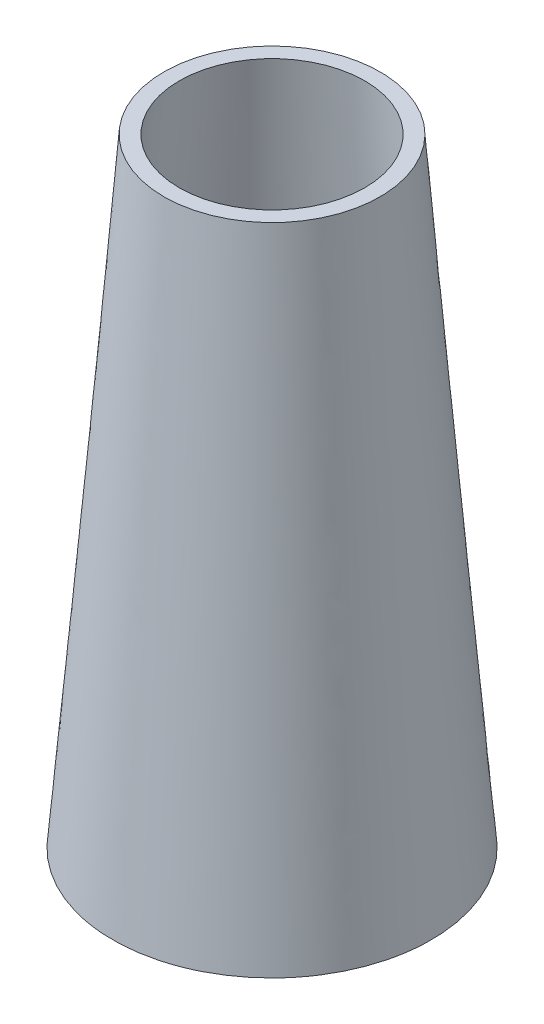
ISO-10303-21;
HEADER;
FILE_DESCRIPTION(('STEP AP214'),'2;1');
FILE_NAME('part.step','',(''),(''),'','','');
FILE_SCHEMA(('AUTOMOTIVE_DESIGN { 1 0 10303 214 1 1 1 1 }'));
ENDSEC;
DATA;
#1=APPLICATION_CONTEXT('core data for automotive mechanical design processes');
#2=APPLICATION_PROTOCOL_DEFINITION('international standard','automotive_design',2000,#1);
#3=PRODUCT_CONTEXT('',#1,'mechanical');
#4=PRODUCT('Part','Part','',(#3));
#5=PRODUCT_RELATED_PRODUCT_CATEGORY('part','',(#4));
#6=PRODUCT_DEFINITION_FORMATION('','',#4);
#7=PRODUCT_DEFINITION_CONTEXT('part definition',#1,'design');
#8=PRODUCT_DEFINITION('design','',#6,#7);
#9=PRODUCT_DEFINITION_SHAPE('','',#8);
#10=(LENGTH_UNIT() NAMED_UNIT(*) SI_UNIT(.MILLI.,.METRE.));
#11=(NAMED_UNIT(*) PLANE_ANGLE_UNIT() SI_UNIT($,.RADIAN.));
#12=(NAMED_UNIT(*) SI_UNIT($,.STERADIAN.) SOLID_ANGLE_UNIT());
#13=UNCERTAINTY_MEASURE_WITH_UNIT(LENGTH_MEASURE(1.E-05),#10,'distance_accuracy_value','');
#14=(GEOMETRIC_REPRESENTATION_CONTEXT(3) GLOBAL_UNCERTAINTY_ASSIGNED_CONTEXT((#13)) GLOBAL_UNIT_ASSIGNED_CONTEXT((#10,
#11,#12)) REPRESENTATION_CONTEXT('',''));
#15=CARTESIAN_POINT('',(0.,0.,0.));
#16=DIRECTION('',(0.,0.,1.));
#17=DIRECTION('',(1.,0.,0.));
#18=AXIS2_PLACEMENT_3D('',#15,#16,#17);
#19=CARTESIAN_POINT('',(0.,0.,0.));
#20=DIRECTION('',(0.,1.,0.));
#21=DIRECTION('',(0.,0.,1.));
#22=AXIS2_PLACEMENT_3D('',#19,#20,#21);
#23=PLANE('',#22);
#24=CARTESIAN_POINT('',(0.,0.,0.));
#25=DIRECTION('',(0.,-1.,0.));
#26=DIRECTION('',(0.,0.,-1.));
#27=AXIS2_PLACEMENT_3D('',#24,#25,#26);
#28=CIRCLE('',#27,4.65);
#29=CARTESIAN_POINT('',(0.,0.,-4.65));
#30=VERTEX_POINT('',#29);
#31=EDGE_CURVE('E58',#30,#30,#28,.T.);
#32=ORIENTED_EDGE('',*,*,#31,.F.);
#33=EDGE_LOOP('',(#32));
#34=FACE_BOUND('',#33,.T.);
#35=CARTESIAN_POINT('',(0.,0.,0.));
#36=DIRECTION('',(0.,1.,0.));
#37=DIRECTION('',(0.,0.,1.));
#38=AXIS2_PLACEMENT_3D('',#35,#36,#37);
#39=CIRCLE('',#38,5.15);
#40=CARTESIAN_POINT('',(-3.032327357634,0.,-4.16263027377456));
#41=VERTEX_POINT('',#40);
#42=EDGE_CURVE('E11',#41,#41,#39,.T.);
#43=ORIENTED_EDGE('',*,*,#42,.F.);
#44=EDGE_LOOP('',(#43));
#45=FACE_BOUND('',#44,.T.);
#46=ADVANCED_FACE('F45',(#34,#45),#23,.F.);
#47=CARTESIAN_POINT('',(0.,19.999999878,0.));
#48=DIRECTION('',(0.,1.,0.));
#49=DIRECTION('',(0.,0.,1.));
#50=AXIS2_PLACEMENT_3D('',#47,#48,#49);
#51=PLANE('',#50);
#52=CARTESIAN_POINT('',(0.,19.999999878,0.));
#53=DIRECTION('',(0.,1.,0.));
#54=DIRECTION('',(0.,0.,1.));
#55=AXIS2_PLACEMENT_3D('',#52,#53,#54);
#56=CIRCLE('',#55,3.);
#57=CARTESIAN_POINT('',(0.,19.999999878,3.));
#58=VERTEX_POINT('',#57);
#59=EDGE_CURVE('E121',#58,#58,#56,.T.);
#60=ORIENTED_EDGE('',*,*,#59,.F.);
#61=EDGE_LOOP('',(#60));
#62=FACE_BOUND('',#61,.T.);
#63=CARTESIAN_POINT('',(0.,19.999999878,0.));
#64=DIRECTION('',(0.,1.,0.));
#65=DIRECTION('',(0.,0.,1.));
#66=AXIS2_PLACEMENT_3D('',#63,#64,#65);
#67=CIRCLE('',#66,3.5);
#68=CARTESIAN_POINT('',(-1.49022752047775,19.999999878,-3.16689468363107));
#69=VERTEX_POINT('',#68);
#70=EDGE_CURVE('E53',#69,#69,#67,.T.);
#71=ORIENTED_EDGE('',*,*,#70,.T.);
#72=EDGE_LOOP('',(#71));
#73=FACE_BOUND('',#72,.T.);
#74=ADVANCED_FACE('F78',(#62,#73),#51,.T.);
#75=CARTESIAN_POINT('',(-1.49022752047775,19.999999878,-3.16689468363107));
#76=CARTESIAN_POINT('',(-3.032327357634,0.,-4.16263027377456));
#77=CARTESIAN_POINT('',(4.84356184678439,19.999999878,-6.14734972458657));
#78=CARTESIAN_POINT('',(5.29293318991512,0.,-10.2272849890425));
#79=CARTESIAN_POINT('',(7.82401688773989,19.999999878,0.186439642675566));
#80=CARTESIAN_POINT('',(11.3575879051831,0.,-1.90202444149344));
#81=CARTESIAN_POINT('',(1.49022752047775,19.999999878,3.16689468363107));
#82=CARTESIAN_POINT('',(3.032327357634,0.,4.16263027377456));
#83=CARTESIAN_POINT('',(-4.84356184678438,19.999999878,6.14734972458657));
#84=CARTESIAN_POINT('',(-5.29293318991512,0.,10.2272849890426));
#85=CARTESIAN_POINT('',(-7.82401688773989,19.999999878,-0.186439642675565));
#86=CARTESIAN_POINT('',(-11.3575879051831,0.,1.90202444149343));
#87=CARTESIAN_POINT('',(-1.49022752047775,19.999999878,-3.16689468363107));
#88=CARTESIAN_POINT('',(-3.032327357634,0.,-4.16263027377456));
#89=(BOUNDED_SURFACE() B_SPLINE_SURFACE(3,1,((#75,#76),(#77,#78),(#79,#80),(#81,#82),(#83,#84),
(#85,#86),(#87,#88)),.UNSPECIFIED.,.T.,.F.,.F.) B_SPLINE_SURFACE_WITH_KNOTS((4,3,4),(2,2),(0.,
0.5,1.),(0.,1.),.UNSPECIFIED.) GEOMETRIC_REPRESENTATION_ITEM() RATIONAL_B_SPLINE_SURFACE(((1.,
1.),(0.333333333333333,0.333333333333333),(0.333333333333333,0.333333333333333),(1.,1.),
(0.333333333333334,0.333333333333333),(0.333333333333334,0.333333333333333),(1.,1.))) REPRESENTATION_ITEM('') SURFACE());
#90=CARTESIAN_POINT('',(-1.49022752047775,19.999999878,-3.16689468363107));
#91=CARTESIAN_POINT('',(-1.50629106044813,19.7916665459375,-3.17726692936173));
#92=CARTESIAN_POINT('',(-1.52235460041851,19.583333213875,-3.18763917509239));
#93=CARTESIAN_POINT('',(-1.55448168035926,19.16666654975,-3.20838366655371));
#94=CARTESIAN_POINT('',(-1.57054522032964,18.9583332176875,-3.21875591228438));
#95=CARTESIAN_POINT('',(-1.60267230027039,18.5416665535625,-3.2395004037457));
#96=CARTESIAN_POINT('',(-1.61873584024077,18.3333332215,-3.24987264947636));
#97=CARTESIAN_POINT('',(-1.65086292018153,17.916666557375,-3.27061714093768));
#98=CARTESIAN_POINT('',(-1.6669264601519,17.7083332253125,-3.28098938666834));
#99=CARTESIAN_POINT('',(-1.69905354009266,17.2916665611875,-3.30173387812967));
#100=CARTESIAN_POINT('',(-1.71511708006304,17.083333229125,-3.31210612386033));
#101=CARTESIAN_POINT('',(-1.74724416000379,16.666666565,-3.33285061532165));
#102=CARTESIAN_POINT('',(-1.76330769997417,16.4583332329375,-3.34322286105231));
#103=CARTESIAN_POINT('',(-1.79543477991493,16.0416665688125,-3.36396735251363));
#104=CARTESIAN_POINT('',(-1.8114983198853,15.83333323675,-3.3743395982443));
#105=CARTESIAN_POINT('',(-1.84362539982606,15.416666572625,-3.39508408970562));
#106=CARTESIAN_POINT('',(-1.85968893979644,15.2083332405625,-3.40545633543628));
#107=CARTESIAN_POINT('',(-1.89181601973719,14.7916665764375,-3.4262008268976));
#108=CARTESIAN_POINT('',(-1.90787955970757,14.583333244375,-3.43657307262826));
#109=CARTESIAN_POINT('',(-1.94000663964832,14.16666658025,-3.45731756408959));
#110=CARTESIAN_POINT('',(-1.9560701796187,13.9583332481875,-3.46768980982025));
#111=CARTESIAN_POINT('',(-1.98819725955946,13.5416665840625,-3.48843430128157));
#112=CARTESIAN_POINT('',(-2.00426079952983,13.333333252,-3.49880654701223));
#113=CARTESIAN_POINT('',(-2.03638787947059,12.916666587875,-3.51955103847355));
#114=CARTESIAN_POINT('',(-2.05245141944097,12.7083332558125,-3.52992328420422));
#115=CARTESIAN_POINT('',(-2.08457849938172,12.2916665916875,-3.55066777566554));
#116=CARTESIAN_POINT('',(-2.1006420393521,12.083333259625,-3.5610400213962));
#117=CARTESIAN_POINT('',(-2.13276911929285,11.6666665955,-3.58178451285752));
#118=CARTESIAN_POINT('',(-2.14883265926323,11.4583332634375,-3.59215675858818));
#119=CARTESIAN_POINT('',(-2.18095973920399,11.0416665993125,-3.61290125004951));
#120=CARTESIAN_POINT('',(-2.19702327917436,10.83333326725,-3.62327349578017));
#121=CARTESIAN_POINT('',(-2.22915035911512,10.416666603125,-3.64401798724149));
#122=CARTESIAN_POINT('',(-2.2452138990855,10.2083332710625,-3.65439023297215));
#123=CARTESIAN_POINT('',(-2.27734097902625,9.7916666069375,-3.67513472443347));
#124=CARTESIAN_POINT('',(-2.29340451899663,9.583333274875,-3.68550697016414));
#125=CARTESIAN_POINT('',(-2.32553159893738,9.16666661075,-3.70625146162546));
#126=CARTESIAN_POINT('',(-2.34159513890776,8.9583332786875,-3.71662370735612));
#127=CARTESIAN_POINT('',(-2.37372221884852,8.5416666145625,-3.73736819881744));
#128=CARTESIAN_POINT('',(-2.38978575881889,8.3333332825,-3.7477404445481));
#129=CARTESIAN_POINT('',(-2.42191283875965,7.916666618375,-3.76848493600943));
#130=CARTESIAN_POINT('',(-2.43797637873003,7.7083332863125,-3.77885718174009));
#131=CARTESIAN_POINT('',(-2.47010345867078,7.2916666221875,-3.79960167320141));
#132=CARTESIAN_POINT('',(-2.48616699864116,7.083333290125,-3.80997391893207));
#133=CARTESIAN_POINT('',(-2.51829407858191,6.666666626,-3.83071841039339));
#134=CARTESIAN_POINT('',(-2.53435761855229,6.4583332939375,-3.84109065612406));
#135=CARTESIAN_POINT('',(-2.56648469849305,6.0416666298125,-3.86183514758538));
#136=CARTESIAN_POINT('',(-2.58254823846342,5.83333329775,-3.87220739331604));
#137=CARTESIAN_POINT('',(-2.61467531840418,5.416666633625,-3.89295188477736));
#138=CARTESIAN_POINT('',(-2.63073885837456,5.2083333015625,-3.90332413050802));
#139=CARTESIAN_POINT('',(-2.66286593831531,4.7916666374375,-3.92406862196935));
#140=CARTESIAN_POINT('',(-2.67892947828569,4.583333305375,-3.93444086770001));
#141=CARTESIAN_POINT('',(-2.71105655822645,4.16666664125,-3.95518535916133));
#142=CARTESIAN_POINT('',(-2.72712009819682,3.9583333091875,-3.96555760489199));
#143=CARTESIAN_POINT('',(-2.75924717813758,3.5416666450625,-3.98630209635331));
#144=CARTESIAN_POINT('',(-2.77531071810796,3.333333313,-3.99667434208398));
#145=CARTESIAN_POINT('',(-2.80743779804871,2.916666648875,-4.0174188335453));
#146=CARTESIAN_POINT('',(-2.82350133801909,2.7083333168125,-4.02779107927596));
#147=CARTESIAN_POINT('',(-2.85562841795984,2.2916666526875,-4.04853557073728));
#148=CARTESIAN_POINT('',(-2.87169195793022,2.083333320625,-4.05890781646794));
#149=CARTESIAN_POINT('',(-2.90381903787098,1.6666666565,-4.07965230792927));
#150=CARTESIAN_POINT('',(-2.91988257784135,1.4583333244375,-4.09002455365993));
#151=CARTESIAN_POINT('',(-2.95200965778211,1.0416666603125,-4.11076904512125));
#152=CARTESIAN_POINT('',(-2.96807319775249,0.83333332825,-4.12114129085191));
#153=CARTESIAN_POINT('',(-3.00020027769324,0.416666664125,-4.14188578231323));
#154=CARTESIAN_POINT('',(-3.01626381766362,0.2083333320625,-4.15225802804389));
#155=CARTESIAN_POINT('',(-3.032327357634,0.,-4.16263027377456));
#156=B_SPLINE_CURVE_WITH_KNOTS('',3,(#90,#91,#92,#93,#94,#95,#96,#97,#98,#99,#100,#101,#102,
#103,#104,#105,#106,#107,#108,#109,#110,#111,#112,#113,#114,#115,#116,#117,#118,#119,#120,#121,
#122,#123,#124,#125,#126,#127,#128,#129,#130,#131,#132,#133,#134,#135,#136,#137,#138,#139,#140,
#141,#142,#143,#144,#145,#146,#147,#148,#149,#150,#151,#152,#153,#154,#155),.UNSPECIFIED.,.F.,
.F.,(4,2,2,2,2,2,2,2,2,2,2,2,2,2,2,2,2,2,2,2,2,2,2,2,2,2,2,2,2,2,2,2,4),(0.,0.627626945259102,
1.2552538905182,1.8828808357773,2.5105077810364,3.1381347262955,3.7657616715546,4.3933886168137,
5.0210155620728,5.6486425073319,6.276269452591,6.9038963978501,7.5315233431092,8.1591502883683,
8.7867772336274,9.4144041788865,10.0420311241456,10.6696580694047,11.2972850146638,
11.9249119599229,12.552538905182,13.1801658504411,13.8077927957002,14.4354197409593,
15.0630466862184,15.6906736314775,16.3183005767366,16.9459275219957,17.5735544672548,
18.2011814125139,18.828808357773,19.4564353030321,20.0840622482912),.UNSPECIFIED.);
#157=EDGE_CURVE('BSEAM87',#69,#41,#156,.T.);
#158=ORIENTED_EDGE('',*,*,#70,.F.);
#159=ORIENTED_EDGE('',*,*,#42,.T.);
#160=ORIENTED_EDGE('',*,*,#157,.T.);
#161=ORIENTED_EDGE('',*,*,#157,.F.);
#162=EDGE_LOOP('',(#158,#160,#159,#161));
#163=FACE_BOUND('',#162,.T.);
#164=ADVANCED_FACE('F87',(#163),#89,.T.);
#165=CARTESIAN_POINT('',(0.,19.999999878,0.));
#166=DIRECTION('',(0.,-1.,0.));
#167=DIRECTION('',(0.,0.,-1.));
#168=AXIS2_PLACEMENT_3D('',#165,#166,#167);
#169=CONICAL_SURFACE('',#168,3.,0.082313589291522);
#170=ORIENTED_EDGE('',*,*,#59,.T.);
#171=EDGE_LOOP('',(#170));
#172=FACE_BOUND('',#171,.T.);
#173=ORIENTED_EDGE('',*,*,#31,.T.);
#174=EDGE_LOOP('',(#173));
#175=FACE_BOUND('',#174,.T.);
#176=ADVANCED_FACE('F89',(#172,#175),#169,.F.);
#177=CLOSED_SHELL('',(#46,#74,#164,#176));
#178=MANIFOLD_SOLID_BREP('B2',#177);
#179=ADVANCED_BREP_SHAPE_REPRESENTATION('',(#18,#178),#14);
#180=SHAPE_DEFINITION_REPRESENTATION(#9,#179);
ENDSEC;
END-ISO-10303-21;
